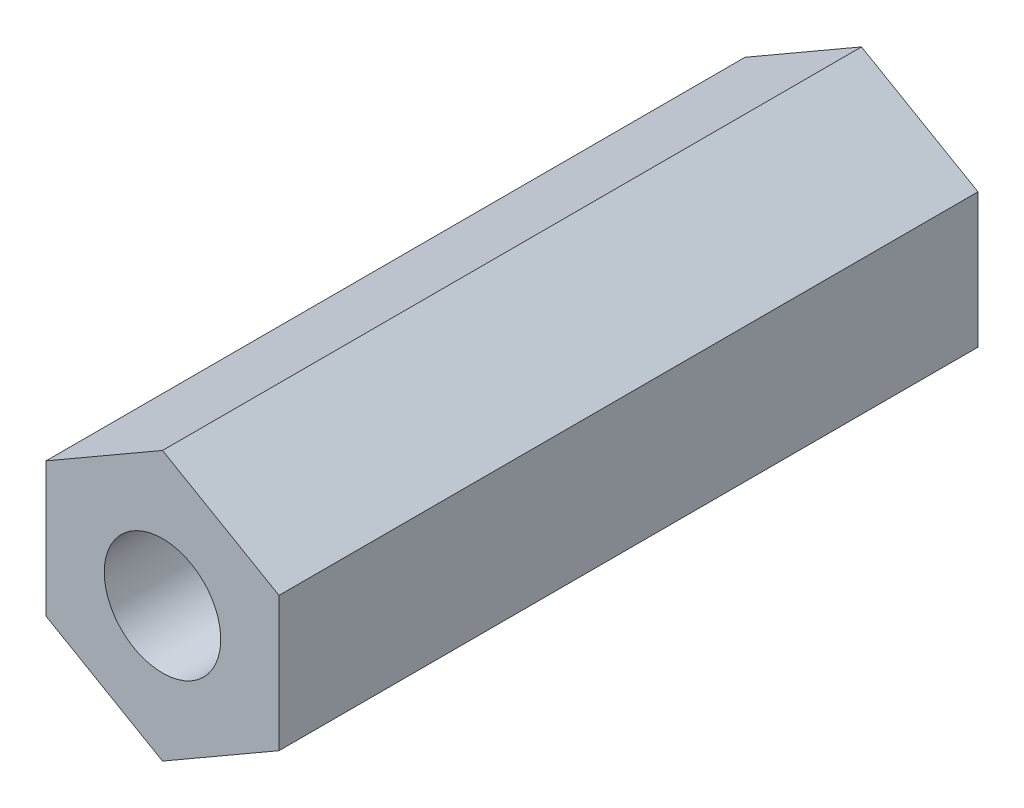
ISO-10303-21;
HEADER;
FILE_DESCRIPTION(('STEP AP214'),'2;1');
FILE_NAME('part.step','',(''),(''),'','','');
FILE_SCHEMA(('AUTOMOTIVE_DESIGN { 1 0 10303 214 1 1 1 1 }'));
ENDSEC;
DATA;
#1=APPLICATION_CONTEXT('core data for automotive mechanical design processes');
#2=APPLICATION_PROTOCOL_DEFINITION('international standard','automotive_design',2000,#1);
#3=PRODUCT_CONTEXT('',#1,'mechanical');
#4=PRODUCT('Part','Part','',(#3));
#5=PRODUCT_RELATED_PRODUCT_CATEGORY('part','',(#4));
#6=PRODUCT_DEFINITION_FORMATION('','',#4);
#7=PRODUCT_DEFINITION_CONTEXT('part definition',#1,'design');
#8=PRODUCT_DEFINITION('design','',#6,#7);
#9=PRODUCT_DEFINITION_SHAPE('','',#8);
#10=(LENGTH_UNIT() NAMED_UNIT(*) SI_UNIT(.MILLI.,.METRE.));
#11=(NAMED_UNIT(*) PLANE_ANGLE_UNIT() SI_UNIT($,.RADIAN.));
#12=(NAMED_UNIT(*) SI_UNIT($,.STERADIAN.) SOLID_ANGLE_UNIT());
#13=UNCERTAINTY_MEASURE_WITH_UNIT(LENGTH_MEASURE(1.E-05),#10,'distance_accuracy_value','');
#14=(GEOMETRIC_REPRESENTATION_CONTEXT(3) GLOBAL_UNCERTAINTY_ASSIGNED_CONTEXT((#13)) GLOBAL_UNIT_ASSIGNED_CONTEXT((#10,
#11,#12)) REPRESENTATION_CONTEXT('',''));
#15=CARTESIAN_POINT('',(0.,0.,0.));
#16=DIRECTION('',(0.,0.,1.));
#17=DIRECTION('',(1.,0.,0.));
#18=AXIS2_PLACEMENT_3D('',#15,#16,#17);
#19=CARTESIAN_POINT('',(3.,1.73205080756888,9.));
#20=DIRECTION('',(-0.499999999999999,-0.866025403784439,0.));
#21=DIRECTION('',(0.866025403784439,-0.499999999999999,0.));
#22=AXIS2_PLACEMENT_3D('',#19,#20,#21);
#23=PLANE('',#22);
#24=DIRECTION('',(-0.866025403784439,0.499999999999999,0.));
#25=VECTOR('',#24,1.);
#26=CARTESIAN_POINT('',(3.,1.73205080756888,-9.));
#27=LINE('',#26,#25);
#28=CARTESIAN_POINT('',(3.,1.73205080756888,-9.00000000000001));
#29=VERTEX_POINT('',#28);
#30=CARTESIAN_POINT('',(0.,3.46410161513775,-9.00000000000001));
#31=VERTEX_POINT('',#30);
#32=EDGE_CURVE('E130',#29,#31,#27,.T.);
#33=ORIENTED_EDGE('',*,*,#32,.T.);
#34=DIRECTION('',(0.,0.,1.));
#35=VECTOR('',#34,1.);
#36=CARTESIAN_POINT('',(0.,3.46410161513775,9.));
#37=LINE('',#36,#35);
#38=CARTESIAN_POINT('',(0.,3.46410161513775,9.));
#39=VERTEX_POINT('',#38);
#40=EDGE_CURVE('E77',#31,#39,#37,.T.);
#41=ORIENTED_EDGE('',*,*,#40,.T.);
#42=DIRECTION('',(-0.866025403784439,0.499999999999999,0.));
#43=VECTOR('',#42,1.);
#44=CARTESIAN_POINT('',(3.,1.73205080756888,9.));
#45=LINE('',#44,#43);
#46=CARTESIAN_POINT('',(3.,1.73205080756888,9.));
#47=VERTEX_POINT('',#46);
#48=EDGE_CURVE('E129',#47,#39,#45,.T.);
#49=ORIENTED_EDGE('',*,*,#48,.F.);
#50=DIRECTION('',(0.,0.,1.));
#51=VECTOR('',#50,1.);
#52=CARTESIAN_POINT('',(3.,1.73205080756888,9.));
#53=LINE('',#52,#51);
#54=EDGE_CURVE('E113',#47,#29,#53,.F.);
#55=ORIENTED_EDGE('',*,*,#54,.T.);
#56=EDGE_LOOP('',(#33,#41,#49,#55));
#57=FACE_BOUND('',#56,.T.);
#58=ADVANCED_FACE('F16',(#57),#23,.F.);
#59=CARTESIAN_POINT('',(0.,3.46410161513775,9.));
#60=DIRECTION('',(0.5,-0.866025403784439,0.));
#61=DIRECTION('',(0.866025403784439,0.5,0.));
#62=AXIS2_PLACEMENT_3D('',#59,#60,#61);
#63=PLANE('',#62);
#64=DIRECTION('',(-0.866025403784439,-0.5,0.));
#65=VECTOR('',#64,1.);
#66=CARTESIAN_POINT('',(0.,3.46410161513775,-9.));
#67=LINE('',#66,#65);
#68=CARTESIAN_POINT('',(-3.,1.73205080756888,-9.));
#69=VERTEX_POINT('',#68);
#70=EDGE_CURVE('E99',#31,#69,#67,.T.);
#71=ORIENTED_EDGE('',*,*,#70,.T.);
#72=DIRECTION('',(0.,0.,-1.));
#73=VECTOR('',#72,1.);
#74=CARTESIAN_POINT('',(-3.,1.73205080756888,9.));
#75=LINE('',#74,#73);
#76=CARTESIAN_POINT('',(-3.,1.73205080756888,9.));
#77=VERTEX_POINT('',#76);
#78=EDGE_CURVE('E84',#69,#77,#75,.F.);
#79=ORIENTED_EDGE('',*,*,#78,.T.);
#80=DIRECTION('',(-0.866025403784439,-0.5,0.));
#81=VECTOR('',#80,1.);
#82=CARTESIAN_POINT('',(0.,3.46410161513775,9.));
#83=LINE('',#82,#81);
#84=EDGE_CURVE('E131',#39,#77,#83,.T.);
#85=ORIENTED_EDGE('',*,*,#84,.F.);
#86=ORIENTED_EDGE('',*,*,#40,.F.);
#87=EDGE_LOOP('',(#71,#79,#85,#86));
#88=FACE_BOUND('',#87,.T.);
#89=ADVANCED_FACE('F106',(#88),#63,.F.);
#90=CARTESIAN_POINT('',(-3.,1.73205080756888,9.));
#91=DIRECTION('',(1.,0.,0.));
#92=DIRECTION('',(0.,0.,-1.));
#93=AXIS2_PLACEMENT_3D('',#90,#91,#92);
#94=PLANE('',#93);
#95=DIRECTION('',(0.,1.,0.));
#96=VECTOR('',#95,1.);
#97=CARTESIAN_POINT('',(-3.,3.46410161513775,-9.));
#98=LINE('',#97,#96);
#99=CARTESIAN_POINT('',(-3.,-1.73205080756888,-9.));
#100=VERTEX_POINT('',#99);
#101=EDGE_CURVE('E88',#69,#100,#98,.F.);
#102=ORIENTED_EDGE('',*,*,#101,.T.);
#103=DIRECTION('',(0.,0.,1.));
#104=VECTOR('',#103,1.);
#105=CARTESIAN_POINT('',(-3.,-1.73205080756888,9.));
#106=LINE('',#105,#104);
#107=CARTESIAN_POINT('',(-3.,-1.73205080756888,9.));
#108=VERTEX_POINT('',#107);
#109=EDGE_CURVE('E91',#100,#108,#106,.T.);
#110=ORIENTED_EDGE('',*,*,#109,.T.);
#111=DIRECTION('',(0.,1.,0.));
#112=VECTOR('',#111,1.);
#113=CARTESIAN_POINT('',(-3.,3.46410161513775,9.));
#114=LINE('',#113,#112);
#115=EDGE_CURVE('E89',#77,#108,#114,.F.);
#116=ORIENTED_EDGE('',*,*,#115,.F.);
#117=ORIENTED_EDGE('',*,*,#78,.F.);
#118=EDGE_LOOP('',(#102,#110,#116,#117));
#119=FACE_BOUND('',#118,.T.);
#120=ADVANCED_FACE('F86',(#119),#94,.F.);
#121=CARTESIAN_POINT('',(-3.,-1.73205080756888,9.));
#122=DIRECTION('',(0.499999999999999,0.866025403784439,0.));
#123=DIRECTION('',(-0.866025403784439,0.499999999999999,0.));
#124=AXIS2_PLACEMENT_3D('',#121,#122,#123);
#125=PLANE('',#124);
#126=DIRECTION('',(0.866025403784439,-0.499999999999999,0.));
#127=VECTOR('',#126,1.);
#128=CARTESIAN_POINT('',(-3.,-1.73205080756888,-9.));
#129=LINE('',#128,#127);
#130=CARTESIAN_POINT('',(0.,-3.46410161513775,-9.));
#131=VERTEX_POINT('',#130);
#132=EDGE_CURVE('E103',#100,#131,#129,.T.);
#133=ORIENTED_EDGE('',*,*,#132,.T.);
#134=DIRECTION('',(0.,0.,1.));
#135=VECTOR('',#134,1.);
#136=CARTESIAN_POINT('',(0.,-3.46410161513775,9.));
#137=LINE('',#136,#135);
#138=CARTESIAN_POINT('',(0.,-3.46410161513775,9.));
#139=VERTEX_POINT('',#138);
#140=EDGE_CURVE('E119',#131,#139,#137,.T.);
#141=ORIENTED_EDGE('',*,*,#140,.T.);
#142=DIRECTION('',(0.866025403784439,-0.499999999999999,0.));
#143=VECTOR('',#142,1.);
#144=CARTESIAN_POINT('',(-3.,-1.73205080756888,9.));
#145=LINE('',#144,#143);
#146=EDGE_CURVE('E136',#108,#139,#145,.T.);
#147=ORIENTED_EDGE('',*,*,#146,.F.);
#148=ORIENTED_EDGE('',*,*,#109,.F.);
#149=EDGE_LOOP('',(#133,#141,#147,#148));
#150=FACE_BOUND('',#149,.T.);
#151=ADVANCED_FACE('F150',(#150),#125,.F.);
#152=CARTESIAN_POINT('',(0.,-3.46410161513775,9.));
#153=DIRECTION('',(-0.5,0.866025403784438,0.));
#154=DIRECTION('',(-0.866025403784438,-0.5,0.));
#155=AXIS2_PLACEMENT_3D('',#152,#153,#154);
#156=PLANE('',#155);
#157=DIRECTION('',(0.866025403784438,0.5,0.));
#158=VECTOR('',#157,1.);
#159=CARTESIAN_POINT('',(0.,-3.46410161513776,-9.));
#160=LINE('',#159,#158);
#161=CARTESIAN_POINT('',(3.,-1.73205080756888,-9.));
#162=VERTEX_POINT('',#161);
#163=EDGE_CURVE('E146',#131,#162,#160,.T.);
#164=ORIENTED_EDGE('',*,*,#163,.T.);
#165=DIRECTION('',(0.,0.,1.));
#166=VECTOR('',#165,1.);
#167=CARTESIAN_POINT('',(3.,-1.73205080756888,9.));
#168=LINE('',#167,#166);
#169=CARTESIAN_POINT('',(3.,-1.73205080756888,9.));
#170=VERTEX_POINT('',#169);
#171=EDGE_CURVE('E108',#162,#170,#168,.T.);
#172=ORIENTED_EDGE('',*,*,#171,.T.);
#173=DIRECTION('',(0.866025403784438,0.5,0.));
#174=VECTOR('',#173,1.);
#175=CARTESIAN_POINT('',(0.,-3.46410161513776,9.));
#176=LINE('',#175,#174);
#177=EDGE_CURVE('E37',#139,#170,#176,.T.);
#178=ORIENTED_EDGE('',*,*,#177,.F.);
#179=ORIENTED_EDGE('',*,*,#140,.F.);
#180=EDGE_LOOP('',(#164,#172,#178,#179));
#181=FACE_BOUND('',#180,.T.);
#182=ADVANCED_FACE('F181',(#181),#156,.F.);
#183=CARTESIAN_POINT('',(3.,-1.73205080756888,9.));
#184=DIRECTION('',(-1.,0.,0.));
#185=DIRECTION('',(0.,-1.,0.));
#186=AXIS2_PLACEMENT_3D('',#183,#184,#185);
#187=PLANE('',#186);
#188=DIRECTION('',(0.,1.,0.));
#189=VECTOR('',#188,1.);
#190=CARTESIAN_POINT('',(3.,3.46410161513775,-9.));
#191=LINE('',#190,#189);
#192=EDGE_CURVE('E143',#162,#29,#191,.T.);
#193=ORIENTED_EDGE('',*,*,#192,.T.);
#194=ORIENTED_EDGE('',*,*,#54,.F.);
#195=DIRECTION('',(0.,1.,0.));
#196=VECTOR('',#195,1.);
#197=CARTESIAN_POINT('',(3.,3.46410161513775,9.));
#198=LINE('',#197,#196);
#199=EDGE_CURVE('E155',#170,#47,#198,.T.);
#200=ORIENTED_EDGE('',*,*,#199,.F.);
#201=ORIENTED_EDGE('',*,*,#171,.F.);
#202=EDGE_LOOP('',(#193,#194,#200,#201));
#203=FACE_BOUND('',#202,.T.);
#204=ADVANCED_FACE('F176',(#203),#187,.F.);
#205=CARTESIAN_POINT('',(0.,3.46410161513775,-9.));
#206=DIRECTION('',(0.,0.,1.));
#207=DIRECTION('',(1.,0.,0.));
#208=AXIS2_PLACEMENT_3D('',#205,#206,#207);
#209=PLANE('',#208);
#210=ORIENTED_EDGE('',*,*,#192,.F.);
#211=ORIENTED_EDGE('',*,*,#163,.F.);
#212=ORIENTED_EDGE('',*,*,#132,.F.);
#213=ORIENTED_EDGE('',*,*,#101,.F.);
#214=ORIENTED_EDGE('',*,*,#70,.F.);
#215=ORIENTED_EDGE('',*,*,#32,.F.);
#216=EDGE_LOOP('',(#210,#211,#212,#213,#214,#215));
#217=FACE_BOUND('',#216,.T.);
#218=CARTESIAN_POINT('',(0.,0.,-9.));
#219=DIRECTION('',(0.,0.,-1.));
#220=DIRECTION('',(-1.,0.,0.));
#221=AXIS2_PLACEMENT_3D('',#218,#219,#220);
#222=CIRCLE('',#221,1.5);
#223=CARTESIAN_POINT('',(-1.5,0.,-9.));
#224=VERTEX_POINT('',#223);
#225=EDGE_CURVE('E19',#224,#224,#222,.F.);
#226=ORIENTED_EDGE('',*,*,#225,.T.);
#227=EDGE_LOOP('',(#226));
#228=FACE_BOUND('',#227,.T.);
#229=ADVANCED_FACE('F96',(#217,#228),#209,.F.);
#230=CARTESIAN_POINT('',(0.,3.46410161513775,9.));
#231=DIRECTION('',(0.,0.,1.));
#232=DIRECTION('',(1.,0.,0.));
#233=AXIS2_PLACEMENT_3D('',#230,#231,#232);
#234=PLANE('',#233);
#235=CARTESIAN_POINT('',(0.,0.,9.));
#236=DIRECTION('',(0.,0.,-1.));
#237=DIRECTION('',(-1.,0.,0.));
#238=AXIS2_PLACEMENT_3D('',#235,#236,#237);
#239=CIRCLE('',#238,1.5);
#240=CARTESIAN_POINT('',(-1.5,0.,9.));
#241=VERTEX_POINT('',#240);
#242=EDGE_CURVE('E11',#241,#241,#239,.T.);
#243=ORIENTED_EDGE('',*,*,#242,.T.);
#244=EDGE_LOOP('',(#243));
#245=FACE_BOUND('',#244,.T.);
#246=ORIENTED_EDGE('',*,*,#177,.T.);
#247=ORIENTED_EDGE('',*,*,#199,.T.);
#248=ORIENTED_EDGE('',*,*,#48,.T.);
#249=ORIENTED_EDGE('',*,*,#84,.T.);
#250=ORIENTED_EDGE('',*,*,#115,.T.);
#251=ORIENTED_EDGE('',*,*,#146,.T.);
#252=EDGE_LOOP('',(#246,#247,#248,#249,#250,#251));
#253=FACE_BOUND('',#252,.T.);
#254=ADVANCED_FACE('F166',(#245,#253),#234,.T.);
#255=CARTESIAN_POINT('',(0.,0.,9.));
#256=DIRECTION('',(0.,0.,-1.));
#257=DIRECTION('',(-1.,0.,0.));
#258=AXIS2_PLACEMENT_3D('',#255,#256,#257);
#259=CYLINDRICAL_SURFACE('',#258,1.5);
#260=ORIENTED_EDGE('',*,*,#225,.F.);
#261=EDGE_LOOP('',(#260));
#262=FACE_BOUND('',#261,.T.);
#263=ORIENTED_EDGE('',*,*,#242,.F.);
#264=EDGE_LOOP('',(#263));
#265=FACE_BOUND('',#264,.T.);
#266=ADVANCED_FACE('F163',(#262,#265),#259,.F.);
#267=CLOSED_SHELL('',(#58,#89,#120,#151,#182,#204,#229,#254,#266));
#268=MANIFOLD_SOLID_BREP('B1',#267);
#269=ADVANCED_BREP_SHAPE_REPRESENTATION('',(#18,#268),#14);
#270=SHAPE_DEFINITION_REPRESENTATION(#9,#269);
ENDSEC;
END-ISO-10303-21;
